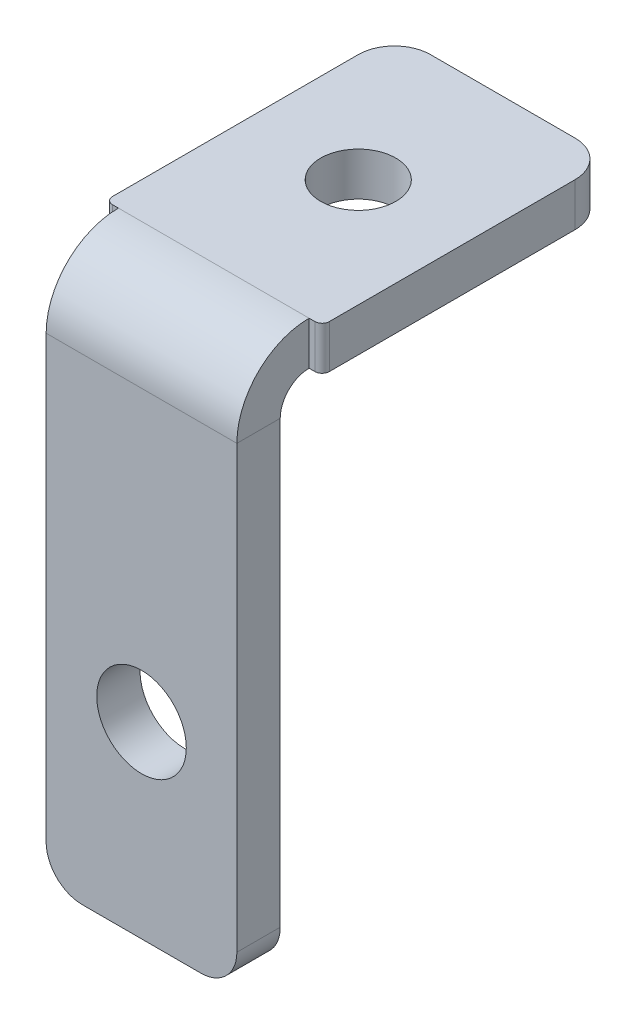
ISO-10303-21;
HEADER;
FILE_DESCRIPTION(('STEP AP214'),'2;1');
FILE_NAME('part.step','',(''),(''),'','','');
FILE_SCHEMA(('AUTOMOTIVE_DESIGN { 1 0 10303 214 1 1 1 1 }'));
ENDSEC;
DATA;
#1=APPLICATION_CONTEXT('core data for automotive mechanical design processes');
#2=APPLICATION_PROTOCOL_DEFINITION('international standard','automotive_design',2000,#1);
#3=PRODUCT_CONTEXT('',#1,'mechanical');
#4=PRODUCT('Part','Part','',(#3));
#5=PRODUCT_RELATED_PRODUCT_CATEGORY('part','',(#4));
#6=PRODUCT_DEFINITION_FORMATION('','',#4);
#7=PRODUCT_DEFINITION_CONTEXT('part definition',#1,'design');
#8=PRODUCT_DEFINITION('design','',#6,#7);
#9=PRODUCT_DEFINITION_SHAPE('','',#8);
#10=(LENGTH_UNIT() NAMED_UNIT(*) SI_UNIT(.MILLI.,.METRE.));
#11=(NAMED_UNIT(*) PLANE_ANGLE_UNIT() SI_UNIT($,.RADIAN.));
#12=(NAMED_UNIT(*) SI_UNIT($,.STERADIAN.) SOLID_ANGLE_UNIT());
#13=UNCERTAINTY_MEASURE_WITH_UNIT(LENGTH_MEASURE(1.E-05),#10,'distance_accuracy_value','');
#14=(GEOMETRIC_REPRESENTATION_CONTEXT(3) GLOBAL_UNCERTAINTY_ASSIGNED_CONTEXT((#13)) GLOBAL_UNIT_ASSIGNED_CONTEXT((#10,
#11,#12)) REPRESENTATION_CONTEXT('',''));
#15=CARTESIAN_POINT('',(0.,0.,0.));
#16=DIRECTION('',(0.,0.,1.));
#17=DIRECTION('',(1.,0.,0.));
#18=AXIS2_PLACEMENT_3D('',#15,#16,#17);
#19=CARTESIAN_POINT('',(6.6,-16.5,-3.));
#20=DIRECTION('',(1.,0.,0.));
#21=DIRECTION('',(0.,0.,-1.));
#22=AXIS2_PLACEMENT_3D('',#19,#20,#21);
#23=PLANE('',#22);
#24=DIRECTION('',(0.,1.,0.));
#25=VECTOR('',#24,1.);
#26=CARTESIAN_POINT('',(6.6,-16.5,0.));
#27=LINE('',#26,#25);
#28=CARTESIAN_POINT('',(6.6,-14.,0.));
#29=VERTEX_POINT('',#28);
#30=CARTESIAN_POINT('',(6.6,16.5,0.));
#31=VERTEX_POINT('',#30);
#32=EDGE_CURVE('E186',#29,#31,#27,.T.);
#33=ORIENTED_EDGE('',*,*,#32,.F.);
#34=DIRECTION('',(0.,0.,1.));
#35=VECTOR('',#34,1.);
#36=CARTESIAN_POINT('',(6.6,-14.,-3.));
#37=LINE('',#36,#35);
#38=CARTESIAN_POINT('',(6.6,-14.,-3.));
#39=VERTEX_POINT('',#38);
#40=EDGE_CURVE('E226',#29,#39,#37,.F.);
#41=ORIENTED_EDGE('',*,*,#40,.T.);
#42=DIRECTION('',(0.,1.,0.));
#43=VECTOR('',#42,1.);
#44=CARTESIAN_POINT('',(6.6,-16.5,-3.));
#45=LINE('',#44,#43);
#46=CARTESIAN_POINT('',(6.6,16.5,-3.));
#47=VERTEX_POINT('',#46);
#48=EDGE_CURVE('E187',#39,#47,#45,.T.);
#49=ORIENTED_EDGE('',*,*,#48,.T.);
#50=DIRECTION('',(0.,0.,1.));
#51=VECTOR('',#50,1.);
#52=CARTESIAN_POINT('',(6.6,16.5,-3.));
#53=LINE('',#52,#51);
#54=EDGE_CURVE('E199',#47,#31,#53,.T.);
#55=ORIENTED_EDGE('',*,*,#54,.T.);
#56=EDGE_LOOP('',(#33,#41,#49,#55));
#57=FACE_BOUND('',#56,.T.);
#58=ADVANCED_FACE('F16',(#57),#23,.T.);
#59=CARTESIAN_POINT('',(-6.6,-16.5,-3.));
#60=DIRECTION('',(0.,-1.,0.));
#61=DIRECTION('',(0.,0.,-1.));
#62=AXIS2_PLACEMENT_3D('',#59,#60,#61);
#63=PLANE('',#62);
#64=DIRECTION('',(1.,0.,0.));
#65=VECTOR('',#64,1.);
#66=CARTESIAN_POINT('',(-6.6,-16.5,-3.));
#67=LINE('',#66,#65);
#68=CARTESIAN_POINT('',(-4.1,-16.5,-3.));
#69=VERTEX_POINT('',#68);
#70=CARTESIAN_POINT('',(4.1,-16.5,-3.));
#71=VERTEX_POINT('',#70);
#72=EDGE_CURVE('E196',#69,#71,#67,.T.);
#73=ORIENTED_EDGE('',*,*,#72,.T.);
#74=DIRECTION('',(0.,0.,1.));
#75=VECTOR('',#74,1.);
#76=CARTESIAN_POINT('',(4.1,-16.5,-3.));
#77=LINE('',#76,#75);
#78=CARTESIAN_POINT('',(4.1,-16.5,0.));
#79=VERTEX_POINT('',#78);
#80=EDGE_CURVE('E219',#71,#79,#77,.T.);
#81=ORIENTED_EDGE('',*,*,#80,.T.);
#82=DIRECTION('',(1.,0.,0.));
#83=VECTOR('',#82,1.);
#84=CARTESIAN_POINT('',(-6.6,-16.5,0.));
#85=LINE('',#84,#83);
#86=CARTESIAN_POINT('',(-4.1,-16.5,0.));
#87=VERTEX_POINT('',#86);
#88=EDGE_CURVE('E190',#87,#79,#85,.T.);
#89=ORIENTED_EDGE('',*,*,#88,.F.);
#90=DIRECTION('',(0.,0.,1.));
#91=VECTOR('',#90,1.);
#92=CARTESIAN_POINT('',(-4.1,-16.5,-3.));
#93=LINE('',#92,#91);
#94=EDGE_CURVE('E214',#87,#69,#93,.F.);
#95=ORIENTED_EDGE('',*,*,#94,.T.);
#96=EDGE_LOOP('',(#73,#81,#89,#95));
#97=FACE_BOUND('',#96,.T.);
#98=ADVANCED_FACE('F290',(#97),#63,.T.);
#99=CARTESIAN_POINT('',(-6.6,-16.5,-3.));
#100=DIRECTION('',(-1.,0.,0.));
#101=DIRECTION('',(0.,0.,1.));
#102=AXIS2_PLACEMENT_3D('',#99,#100,#101);
#103=PLANE('',#102);
#104=DIRECTION('',(0.,-1.,0.));
#105=VECTOR('',#104,1.);
#106=CARTESIAN_POINT('',(-6.6,-16.5,-3.));
#107=LINE('',#106,#105);
#108=CARTESIAN_POINT('',(-6.6,16.5,-3.));
#109=VERTEX_POINT('',#108);
#110=CARTESIAN_POINT('',(-6.6,-14.,-3.));
#111=VERTEX_POINT('',#110);
#112=EDGE_CURVE('E193',#109,#111,#107,.T.);
#113=ORIENTED_EDGE('',*,*,#112,.T.);
#114=DIRECTION('',(0.,0.,1.));
#115=VECTOR('',#114,1.);
#116=CARTESIAN_POINT('',(-6.6,-14.,-3.));
#117=LINE('',#116,#115);
#118=CARTESIAN_POINT('',(-6.6,-14.,0.));
#119=VERTEX_POINT('',#118);
#120=EDGE_CURVE('E232',#111,#119,#117,.T.);
#121=ORIENTED_EDGE('',*,*,#120,.T.);
#122=DIRECTION('',(0.,-1.,0.));
#123=VECTOR('',#122,1.);
#124=CARTESIAN_POINT('',(-6.6,-16.5,0.));
#125=LINE('',#124,#123);
#126=CARTESIAN_POINT('',(-6.6,16.5,0.));
#127=VERTEX_POINT('',#126);
#128=EDGE_CURVE('E206',#127,#119,#125,.T.);
#129=ORIENTED_EDGE('',*,*,#128,.F.);
#130=DIRECTION('',(0.,0.,1.));
#131=VECTOR('',#130,1.);
#132=CARTESIAN_POINT('',(-6.6,16.5,-3.));
#133=LINE('',#132,#131);
#134=EDGE_CURVE('E137',#109,#127,#133,.T.);
#135=ORIENTED_EDGE('',*,*,#134,.F.);
#136=EDGE_LOOP('',(#113,#121,#129,#135));
#137=FACE_BOUND('',#136,.T.);
#138=ADVANCED_FACE('F296',(#137),#103,.T.);
#139=CARTESIAN_POINT('',(0.,0.,-3.));
#140=DIRECTION('',(0.,0.,-1.));
#141=DIRECTION('',(-1.,0.,0.));
#142=AXIS2_PLACEMENT_3D('',#139,#140,#141);
#143=PLANE('',#142);
#144=CARTESIAN_POINT('',(0.,-3.50000000000131,-3.));
#145=DIRECTION('',(0.,0.,1.));
#146=DIRECTION('',(1.,0.,0.));
#147=AXIS2_PLACEMENT_3D('',#144,#145,#146);
#148=CIRCLE('',#147,3.1);
#149=CARTESIAN_POINT('',(3.1,-3.50000000000131,-3.));
#150=VERTEX_POINT('',#149);
#151=EDGE_CURVE('E402',#150,#150,#148,.T.);
#152=ORIENTED_EDGE('',*,*,#151,.T.);
#153=EDGE_LOOP('',(#152));
#154=FACE_BOUND('',#153,.T.);
#155=ORIENTED_EDGE('',*,*,#48,.F.);
#156=CARTESIAN_POINT('',(4.1,-14.,-3.));
#157=DIRECTION('',(0.,0.,-1.));
#158=DIRECTION('',(-1.,0.,0.));
#159=AXIS2_PLACEMENT_3D('',#156,#157,#158);
#160=CIRCLE('',#159,2.5);
#161=EDGE_CURVE('E230',#39,#71,#160,.T.);
#162=ORIENTED_EDGE('',*,*,#161,.T.);
#163=ORIENTED_EDGE('',*,*,#72,.F.);
#164=CARTESIAN_POINT('',(-4.1,-14.,-3.));
#165=DIRECTION('',(0.,0.,-1.));
#166=DIRECTION('',(-1.,0.,0.));
#167=AXIS2_PLACEMENT_3D('',#164,#165,#166);
#168=CIRCLE('',#167,2.5);
#169=EDGE_CURVE('E228',#69,#111,#168,.T.);
#170=ORIENTED_EDGE('',*,*,#169,.T.);
#171=ORIENTED_EDGE('',*,*,#112,.F.);
#172=DIRECTION('',(-1.,0.,0.));
#173=VECTOR('',#172,1.);
#174=CARTESIAN_POINT('',(-6.6,16.5,-3.));
#175=LINE('',#174,#173);
#176=EDGE_CURVE('E189',#47,#109,#175,.T.);
#177=ORIENTED_EDGE('',*,*,#176,.F.);
#178=EDGE_LOOP('',(#155,#162,#163,#170,#171,#177));
#179=FACE_BOUND('',#178,.T.);
#180=ADVANCED_FACE('F375',(#154,#179),#143,.T.);
#181=CARTESIAN_POINT('',(0.,0.,0.));
#182=DIRECTION('',(0.,0.,-1.));
#183=DIRECTION('',(-1.,0.,0.));
#184=AXIS2_PLACEMENT_3D('',#181,#182,#183);
#185=PLANE('',#184);
#186=CARTESIAN_POINT('',(0.,-3.50000000000131,0.));
#187=DIRECTION('',(0.,0.,1.));
#188=DIRECTION('',(1.,0.,0.));
#189=AXIS2_PLACEMENT_3D('',#186,#187,#188);
#190=CIRCLE('',#189,3.1);
#191=CARTESIAN_POINT('',(3.1,-3.50000000000131,0.));
#192=VERTEX_POINT('',#191);
#193=EDGE_CURVE('E338',#192,#192,#190,.T.);
#194=ORIENTED_EDGE('',*,*,#193,.F.);
#195=EDGE_LOOP('',(#194));
#196=FACE_BOUND('',#195,.T.);
#197=ORIENTED_EDGE('',*,*,#88,.T.);
#198=CARTESIAN_POINT('',(4.1,-14.,0.));
#199=DIRECTION('',(0.,0.,-1.));
#200=DIRECTION('',(-1.,0.,0.));
#201=AXIS2_PLACEMENT_3D('',#198,#199,#200);
#202=CIRCLE('',#201,2.5);
#203=EDGE_CURVE('E224',#79,#29,#202,.F.);
#204=ORIENTED_EDGE('',*,*,#203,.T.);
#205=ORIENTED_EDGE('',*,*,#32,.T.);
#206=DIRECTION('',(-1.,0.,0.));
#207=VECTOR('',#206,1.);
#208=CARTESIAN_POINT('',(-6.6,16.5,0.));
#209=LINE('',#208,#207);
#210=EDGE_CURVE('E202',#31,#127,#209,.T.);
#211=ORIENTED_EDGE('',*,*,#210,.T.);
#212=ORIENTED_EDGE('',*,*,#128,.T.);
#213=CARTESIAN_POINT('',(-4.1,-14.,0.));
#214=DIRECTION('',(0.,0.,-1.));
#215=DIRECTION('',(-1.,0.,0.));
#216=AXIS2_PLACEMENT_3D('',#213,#214,#215);
#217=CIRCLE('',#216,2.5);
#218=EDGE_CURVE('E222',#119,#87,#217,.F.);
#219=ORIENTED_EDGE('',*,*,#218,.T.);
#220=EDGE_LOOP('',(#197,#204,#205,#211,#212,#219));
#221=FACE_BOUND('',#220,.T.);
#222=ADVANCED_FACE('F371',(#196,#221),#185,.F.);
#223=CARTESIAN_POINT('',(-6.6,16.5,-5.));
#224=DIRECTION('',(-1.,0.,0.));
#225=DIRECTION('',(0.,0.,1.));
#226=AXIS2_PLACEMENT_3D('',#223,#224,#225);
#227=PLANE('',#226);
#228=DIRECTION('',(0.,1.,0.));
#229=VECTOR('',#228,1.);
#230=CARTESIAN_POINT('',(-6.6,18.5,-4.99999999999999));
#231=LINE('',#230,#229);
#232=CARTESIAN_POINT('',(-6.6,18.5,-4.99999999999999));
#233=VERTEX_POINT('',#232);
#234=CARTESIAN_POINT('',(-6.6,21.5,-4.99999999999998));
#235=VERTEX_POINT('',#234);
#236=EDGE_CURVE('E134',#233,#235,#231,.T.);
#237=ORIENTED_EDGE('',*,*,#236,.F.);
#238=CARTESIAN_POINT('',(-6.6,16.5,-5.));
#239=DIRECTION('',(1.,0.,0.));
#240=DIRECTION('',(0.,0.,-1.));
#241=AXIS2_PLACEMENT_3D('',#238,#239,#240);
#242=CIRCLE('',#241,2.);
#243=EDGE_CURVE('E152',#109,#233,#242,.F.);
#244=ORIENTED_EDGE('',*,*,#243,.F.);
#245=ORIENTED_EDGE('',*,*,#134,.T.);
#246=CARTESIAN_POINT('',(-6.6,16.5,-5.));
#247=DIRECTION('',(1.,0.,0.));
#248=DIRECTION('',(0.,0.,-1.));
#249=AXIS2_PLACEMENT_3D('',#246,#247,#248);
#250=CIRCLE('',#249,5.);
#251=EDGE_CURVE('E129',#127,#235,#250,.F.);
#252=ORIENTED_EDGE('',*,*,#251,.T.);
#253=EDGE_LOOP('',(#237,#244,#245,#252));
#254=FACE_BOUND('',#253,.T.);
#255=ADVANCED_FACE('F131',(#254),#227,.T.);
#256=CARTESIAN_POINT('',(6.6,16.5,-5.));
#257=DIRECTION('',(-1.,0.,0.));
#258=DIRECTION('',(0.,0.,1.));
#259=AXIS2_PLACEMENT_3D('',#256,#257,#258);
#260=PLANE('',#259);
#261=CARTESIAN_POINT('',(6.6,16.5,-5.));
#262=DIRECTION('',(1.,0.,0.));
#263=DIRECTION('',(0.,0.,-1.));
#264=AXIS2_PLACEMENT_3D('',#261,#262,#263);
#265=CIRCLE('',#264,2.);
#266=CARTESIAN_POINT('',(6.6,18.5,-4.99999999999999));
#267=VERTEX_POINT('',#266);
#268=EDGE_CURVE('E177',#267,#47,#265,.T.);
#269=ORIENTED_EDGE('',*,*,#268,.F.);
#270=DIRECTION('',(0.,1.,0.));
#271=VECTOR('',#270,1.);
#272=CARTESIAN_POINT('',(6.6,18.5,-4.99999999999999));
#273=LINE('',#272,#271);
#274=CARTESIAN_POINT('',(6.6,21.5,-4.99999999999998));
#275=VERTEX_POINT('',#274);
#276=EDGE_CURVE('E161',#267,#275,#273,.T.);
#277=ORIENTED_EDGE('',*,*,#276,.T.);
#278=CARTESIAN_POINT('',(6.6,16.5,-5.));
#279=DIRECTION('',(1.,0.,0.));
#280=DIRECTION('',(0.,0.,-1.));
#281=AXIS2_PLACEMENT_3D('',#278,#279,#280);
#282=CIRCLE('',#281,5.);
#283=EDGE_CURVE('E141',#275,#31,#282,.T.);
#284=ORIENTED_EDGE('',*,*,#283,.T.);
#285=ORIENTED_EDGE('',*,*,#54,.F.);
#286=EDGE_LOOP('',(#269,#277,#284,#285));
#287=FACE_BOUND('',#286,.T.);
#288=ADVANCED_FACE('F365',(#287),#260,.F.);
#289=CARTESIAN_POINT('',(6.6,16.5,-5.));
#290=DIRECTION('',(1.,0.,0.));
#291=DIRECTION('',(0.,1.,0.));
#292=AXIS2_PLACEMENT_3D('',#289,#290,#291);
#293=CYLINDRICAL_SURFACE('',#292,5.);
#294=ORIENTED_EDGE('',*,*,#210,.F.);
#295=ORIENTED_EDGE('',*,*,#283,.F.);
#296=DIRECTION('',(1.,0.,0.));
#297=VECTOR('',#296,1.);
#298=CARTESIAN_POINT('',(6.6,21.5,-4.99999999999998));
#299=LINE('',#298,#297);
#300=EDGE_CURVE('E145',#235,#275,#299,.T.);
#301=ORIENTED_EDGE('',*,*,#300,.F.);
#302=ORIENTED_EDGE('',*,*,#251,.F.);
#303=EDGE_LOOP('',(#294,#295,#301,#302));
#304=FACE_BOUND('',#303,.T.);
#305=ADVANCED_FACE('F146',(#304),#293,.T.);
#306=CARTESIAN_POINT('',(6.6,16.5,-5.));
#307=DIRECTION('',(1.,0.,0.));
#308=DIRECTION('',(0.,1.,0.));
#309=AXIS2_PLACEMENT_3D('',#306,#307,#308);
#310=CYLINDRICAL_SURFACE('',#309,2.);
#311=ORIENTED_EDGE('',*,*,#176,.T.);
#312=ORIENTED_EDGE('',*,*,#243,.T.);
#313=DIRECTION('',(1.,0.,0.));
#314=VECTOR('',#313,1.);
#315=CARTESIAN_POINT('',(6.6,18.5,-4.99999999999999));
#316=LINE('',#315,#314);
#317=EDGE_CURVE('E180',#233,#267,#316,.T.);
#318=ORIENTED_EDGE('',*,*,#317,.T.);
#319=ORIENTED_EDGE('',*,*,#268,.T.);
#320=EDGE_LOOP('',(#311,#312,#318,#319));
#321=FACE_BOUND('',#320,.T.);
#322=ADVANCED_FACE('F364',(#321),#310,.F.);
#323=CARTESIAN_POINT('',(-7.5,18.5,-4.99999999999999));
#324=DIRECTION('',(0.,0.,1.));
#325=DIRECTION('',(0.,-1.,0.));
#326=AXIS2_PLACEMENT_3D('',#323,#324,#325);
#327=PLANE('',#326);
#328=DIRECTION('',(1.,0.,0.));
#329=VECTOR('',#328,1.);
#330=CARTESIAN_POINT('',(-7.5,18.5,-4.99999999999999));
#331=LINE('',#330,#329);
#332=CARTESIAN_POINT('',(7.,18.5,-4.99999999999999));
#333=VERTEX_POINT('',#332);
#334=EDGE_CURVE('E169',#267,#333,#331,.T.);
#335=ORIENTED_EDGE('',*,*,#334,.T.);
#336=DIRECTION('',(0.,1.,0.));
#337=VECTOR('',#336,1.);
#338=CARTESIAN_POINT('',(7.,21.5,-4.99999999999998));
#339=LINE('',#338,#337);
#340=CARTESIAN_POINT('',(7.,21.5,-4.99999999999998));
#341=VERTEX_POINT('',#340);
#342=EDGE_CURVE('E24',#333,#341,#339,.T.);
#343=ORIENTED_EDGE('',*,*,#342,.T.);
#344=DIRECTION('',(1.,0.,0.));
#345=VECTOR('',#344,1.);
#346=CARTESIAN_POINT('',(-7.5,21.5,-4.99999999999998));
#347=LINE('',#346,#345);
#348=EDGE_CURVE('E166',#341,#275,#347,.F.);
#349=ORIENTED_EDGE('',*,*,#348,.T.);
#350=ORIENTED_EDGE('',*,*,#276,.F.);
#351=EDGE_LOOP('',(#335,#343,#349,#350));
#352=FACE_BOUND('',#351,.T.);
#353=ADVANCED_FACE('F270',(#352),#327,.T.);
#354=CARTESIAN_POINT('',(7.5,21.5000000000001,-25.));
#355=DIRECTION('',(-1.,0.,0.));
#356=DIRECTION('',(0.,0.,1.));
#357=AXIS2_PLACEMENT_3D('',#354,#355,#356);
#358=PLANE('',#357);
#359=DIRECTION('',(0.,0.,-1.));
#360=VECTOR('',#359,1.);
#361=CARTESIAN_POINT('',(7.5,21.5,0.));
#362=LINE('',#361,#360);
#363=CARTESIAN_POINT('',(7.5,21.5,-5.49999999999998));
#364=VERTEX_POINT('',#363);
#365=CARTESIAN_POINT('',(7.5,21.5000000000001,-22.5));
#366=VERTEX_POINT('',#365);
#367=EDGE_CURVE('E273',#364,#366,#362,.T.);
#368=ORIENTED_EDGE('',*,*,#367,.F.);
#369=DIRECTION('',(0.,1.,0.));
#370=VECTOR('',#369,1.);
#371=CARTESIAN_POINT('',(7.5,18.5,-5.49999999999999));
#372=LINE('',#371,#370);
#373=CARTESIAN_POINT('',(7.5,18.5,-5.49999999999999));
#374=VERTEX_POINT('',#373);
#375=EDGE_CURVE('E10',#364,#374,#372,.F.);
#376=ORIENTED_EDGE('',*,*,#375,.T.);
#377=DIRECTION('',(0.,0.,1.));
#378=VECTOR('',#377,1.);
#379=CARTESIAN_POINT('',(7.5,18.5000000000001,-25.));
#380=LINE('',#379,#378);
#381=CARTESIAN_POINT('',(7.5,18.5000000000001,-22.5));
#382=VERTEX_POINT('',#381);
#383=EDGE_CURVE('E168',#374,#382,#380,.F.);
#384=ORIENTED_EDGE('',*,*,#383,.T.);
#385=DIRECTION('',(0.,-1.,0.));
#386=VECTOR('',#385,1.);
#387=CARTESIAN_POINT('',(7.5,21.5000000000001,-22.5));
#388=LINE('',#387,#386);
#389=EDGE_CURVE('E246',#382,#366,#388,.F.);
#390=ORIENTED_EDGE('',*,*,#389,.T.);
#391=EDGE_LOOP('',(#368,#376,#384,#390));
#392=FACE_BOUND('',#391,.T.);
#393=ADVANCED_FACE('F274',(#392),#358,.F.);
#394=CARTESIAN_POINT('',(-7.5,21.5,-2.99999999999999));
#395=DIRECTION('',(1.,0.,0.));
#396=DIRECTION('',(0.,0.,-1.));
#397=AXIS2_PLACEMENT_3D('',#394,#395,#396);
#398=PLANE('',#397);
#399=DIRECTION('',(0.,0.,-1.));
#400=VECTOR('',#399,1.);
#401=CARTESIAN_POINT('',(-7.5,18.5,-3.));
#402=LINE('',#401,#400);
#403=CARTESIAN_POINT('',(-7.5,18.5000000000001,-22.5));
#404=VERTEX_POINT('',#403);
#405=CARTESIAN_POINT('',(-7.5,18.5,-5.49999999999999));
#406=VERTEX_POINT('',#405);
#407=EDGE_CURVE('E279',#404,#406,#402,.F.);
#408=ORIENTED_EDGE('',*,*,#407,.T.);
#409=DIRECTION('',(0.,1.,0.));
#410=VECTOR('',#409,1.);
#411=CARTESIAN_POINT('',(-7.5,21.5,-5.49999999999998));
#412=LINE('',#411,#410);
#413=CARTESIAN_POINT('',(-7.5,21.5,-5.49999999999998));
#414=VERTEX_POINT('',#413);
#415=EDGE_CURVE('E257',#406,#414,#412,.T.);
#416=ORIENTED_EDGE('',*,*,#415,.T.);
#417=DIRECTION('',(0.,0.,1.));
#418=VECTOR('',#417,1.);
#419=CARTESIAN_POINT('',(-7.5,21.5,0.));
#420=LINE('',#419,#418);
#421=CARTESIAN_POINT('',(-7.5,21.5000000000001,-22.5));
#422=VERTEX_POINT('',#421);
#423=EDGE_CURVE('E182',#422,#414,#420,.T.);
#424=ORIENTED_EDGE('',*,*,#423,.F.);
#425=DIRECTION('',(0.,-1.,0.));
#426=VECTOR('',#425,1.);
#427=CARTESIAN_POINT('',(-7.5,21.5000000000001,-22.5));
#428=LINE('',#427,#426);
#429=EDGE_CURVE('E253',#422,#404,#428,.T.);
#430=ORIENTED_EDGE('',*,*,#429,.T.);
#431=EDGE_LOOP('',(#408,#416,#424,#430));
#432=FACE_BOUND('',#431,.T.);
#433=ADVANCED_FACE('F331',(#432),#398,.F.);
#434=CARTESIAN_POINT('',(0.,21.5,0.));
#435=DIRECTION('',(0.,-1.,0.));
#436=DIRECTION('',(0.,0.,-1.));
#437=AXIS2_PLACEMENT_3D('',#434,#435,#436);
#438=PLANE('',#437);
#439=CARTESIAN_POINT('',(0.,21.5,-15.));
#440=DIRECTION('',(0.,1.,0.));
#441=DIRECTION('',(0.,0.,1.));
#442=AXIS2_PLACEMENT_3D('',#439,#440,#441);
#443=CIRCLE('',#442,2.6);
#444=CARTESIAN_POINT('',(0.,21.5,-12.4));
#445=VERTEX_POINT('',#444);
#446=EDGE_CURVE('E411',#445,#445,#443,.T.);
#447=ORIENTED_EDGE('',*,*,#446,.F.);
#448=EDGE_LOOP('',(#447));
#449=FACE_BOUND('',#448,.T.);
#450=ORIENTED_EDGE('',*,*,#423,.T.);
#451=CARTESIAN_POINT('',(-7.,21.5,-5.49999999999998));
#452=DIRECTION('',(0.,-1.,0.));
#453=DIRECTION('',(0.,0.,-1.));
#454=AXIS2_PLACEMENT_3D('',#451,#452,#453);
#455=CIRCLE('',#454,0.5);
#456=CARTESIAN_POINT('',(-7.,21.5,-4.99999999999998));
#457=VERTEX_POINT('',#456);
#458=EDGE_CURVE('E165',#414,#457,#455,.F.);
#459=ORIENTED_EDGE('',*,*,#458,.T.);
#460=EDGE_CURVE('E157',#235,#457,#347,.F.);
#461=ORIENTED_EDGE('',*,*,#460,.F.);
#462=ORIENTED_EDGE('',*,*,#300,.T.);
#463=ORIENTED_EDGE('',*,*,#348,.F.);
#464=CARTESIAN_POINT('',(7.,21.5,-5.49999999999998));
#465=DIRECTION('',(0.,-1.,0.));
#466=DIRECTION('',(0.,0.,-1.));
#467=AXIS2_PLACEMENT_3D('',#464,#465,#466);
#468=CIRCLE('',#467,0.5);
#469=EDGE_CURVE('E260',#341,#364,#468,.F.);
#470=ORIENTED_EDGE('',*,*,#469,.T.);
#471=ORIENTED_EDGE('',*,*,#367,.T.);
#472=CARTESIAN_POINT('',(5.,21.5000000000001,-22.5));
#473=DIRECTION('',(0.,-1.,0.));
#474=DIRECTION('',(0.,0.,-1.));
#475=AXIS2_PLACEMENT_3D('',#472,#473,#474);
#476=CIRCLE('',#475,2.5);
#477=CARTESIAN_POINT('',(5.,21.5000000000001,-25.));
#478=VERTEX_POINT('',#477);
#479=EDGE_CURVE('E251',#366,#478,#476,.F.);
#480=ORIENTED_EDGE('',*,*,#479,.T.);
#481=DIRECTION('',(-1.,0.,0.));
#482=VECTOR('',#481,1.);
#483=CARTESIAN_POINT('',(0.,21.5000000000001,-25.));
#484=LINE('',#483,#482);
#485=CARTESIAN_POINT('',(-5.,21.5000000000001,-25.));
#486=VERTEX_POINT('',#485);
#487=EDGE_CURVE('E278',#478,#486,#484,.T.);
#488=ORIENTED_EDGE('',*,*,#487,.T.);
#489=CARTESIAN_POINT('',(-5.,21.5000000000001,-22.5));
#490=DIRECTION('',(0.,-1.,0.));
#491=DIRECTION('',(0.,0.,-1.));
#492=AXIS2_PLACEMENT_3D('',#489,#490,#491);
#493=CIRCLE('',#492,2.5);
#494=EDGE_CURVE('E249',#486,#422,#493,.F.);
#495=ORIENTED_EDGE('',*,*,#494,.T.);
#496=EDGE_LOOP('',(#450,#459,#461,#462,#463,#470,#471,#480,#488,#495));
#497=FACE_BOUND('',#496,.T.);
#498=ADVANCED_FACE('F164',(#449,#497),#438,.F.);
#499=CARTESIAN_POINT('',(0.,18.5,0.));
#500=DIRECTION('',(0.,-1.,0.));
#501=DIRECTION('',(0.,0.,-1.));
#502=AXIS2_PLACEMENT_3D('',#499,#500,#501);
#503=PLANE('',#502);
#504=CARTESIAN_POINT('',(0.,18.5,-15.));
#505=DIRECTION('',(0.,1.,0.));
#506=DIRECTION('',(0.,0.,1.));
#507=AXIS2_PLACEMENT_3D('',#504,#505,#506);
#508=CIRCLE('',#507,2.6);
#509=CARTESIAN_POINT('',(0.,18.5,-12.4));
#510=VERTEX_POINT('',#509);
#511=EDGE_CURVE('E409',#510,#510,#508,.T.);
#512=ORIENTED_EDGE('',*,*,#511,.T.);
#513=EDGE_LOOP('',(#512));
#514=FACE_BOUND('',#513,.T.);
#515=CARTESIAN_POINT('',(-7.,18.5,-4.99999999999999));
#516=VERTEX_POINT('',#515);
#517=EDGE_CURVE('E160',#516,#233,#331,.T.);
#518=ORIENTED_EDGE('',*,*,#517,.F.);
#519=CARTESIAN_POINT('',(-7.,18.5,-5.49999999999999));
#520=DIRECTION('',(0.,-1.,0.));
#521=DIRECTION('',(0.,0.,-1.));
#522=AXIS2_PLACEMENT_3D('',#519,#520,#521);
#523=CIRCLE('',#522,0.5);
#524=EDGE_CURVE('E266',#516,#406,#523,.T.);
#525=ORIENTED_EDGE('',*,*,#524,.T.);
#526=ORIENTED_EDGE('',*,*,#407,.F.);
#527=CARTESIAN_POINT('',(-5.,18.5000000000001,-22.5));
#528=DIRECTION('',(0.,-1.,0.));
#529=DIRECTION('',(0.,0.,-1.));
#530=AXIS2_PLACEMENT_3D('',#527,#528,#529);
#531=CIRCLE('',#530,2.5);
#532=CARTESIAN_POINT('',(-5.,18.5000000000001,-25.));
#533=VERTEX_POINT('',#532);
#534=EDGE_CURVE('E241',#404,#533,#531,.T.);
#535=ORIENTED_EDGE('',*,*,#534,.T.);
#536=DIRECTION('',(1.,0.,0.));
#537=VECTOR('',#536,1.);
#538=CARTESIAN_POINT('',(-7.5,18.5000000000001,-25.));
#539=LINE('',#538,#537);
#540=CARTESIAN_POINT('',(5.,18.5000000000001,-25.));
#541=VERTEX_POINT('',#540);
#542=EDGE_CURVE('E342',#541,#533,#539,.F.);
#543=ORIENTED_EDGE('',*,*,#542,.F.);
#544=CARTESIAN_POINT('',(5.,18.5000000000001,-22.5));
#545=DIRECTION('',(0.,-1.,0.));
#546=DIRECTION('',(0.,0.,-1.));
#547=AXIS2_PLACEMENT_3D('',#544,#545,#546);
#548=CIRCLE('',#547,2.5);
#549=EDGE_CURVE('E243',#541,#382,#548,.T.);
#550=ORIENTED_EDGE('',*,*,#549,.T.);
#551=ORIENTED_EDGE('',*,*,#383,.F.);
#552=CARTESIAN_POINT('',(7.,18.5,-5.49999999999999));
#553=DIRECTION('',(0.,-1.,0.));
#554=DIRECTION('',(0.,0.,-1.));
#555=AXIS2_PLACEMENT_3D('',#552,#553,#554);
#556=CIRCLE('',#555,0.5);
#557=EDGE_CURVE('E31',#374,#333,#556,.T.);
#558=ORIENTED_EDGE('',*,*,#557,.T.);
#559=ORIENTED_EDGE('',*,*,#334,.F.);
#560=ORIENTED_EDGE('',*,*,#317,.F.);
#561=EDGE_LOOP('',(#518,#525,#526,#535,#543,#550,#551,#558,#559,#560));
#562=FACE_BOUND('',#561,.T.);
#563=ADVANCED_FACE('F346',(#514,#562),#503,.T.);
#564=CARTESIAN_POINT('',(-7.5,21.5000000000001,-25.));
#565=DIRECTION('',(0.,0.,1.));
#566=DIRECTION('',(0.,-1.,0.));
#567=AXIS2_PLACEMENT_3D('',#564,#565,#566);
#568=PLANE('',#567);
#569=ORIENTED_EDGE('',*,*,#487,.F.);
#570=DIRECTION('',(0.,-1.,0.));
#571=VECTOR('',#570,1.);
#572=CARTESIAN_POINT('',(5.,21.5000000000001,-25.));
#573=LINE('',#572,#571);
#574=EDGE_CURVE('E237',#478,#541,#573,.T.);
#575=ORIENTED_EDGE('',*,*,#574,.T.);
#576=ORIENTED_EDGE('',*,*,#542,.T.);
#577=DIRECTION('',(0.,-1.,0.));
#578=VECTOR('',#577,1.);
#579=CARTESIAN_POINT('',(-5.,21.5000000000001,-25.));
#580=LINE('',#579,#578);
#581=EDGE_CURVE('E235',#533,#486,#580,.F.);
#582=ORIENTED_EDGE('',*,*,#581,.T.);
#583=EDGE_LOOP('',(#569,#575,#576,#582));
#584=FACE_BOUND('',#583,.T.);
#585=ADVANCED_FACE('F348',(#584),#568,.F.);
#586=ORIENTED_EDGE('',*,*,#460,.T.);
#587=DIRECTION('',(0.,1.,0.));
#588=VECTOR('',#587,1.);
#589=CARTESIAN_POINT('',(-7.,18.5,-4.99999999999999));
#590=LINE('',#589,#588);
#591=EDGE_CURVE('E263',#457,#516,#590,.F.);
#592=ORIENTED_EDGE('',*,*,#591,.T.);
#593=ORIENTED_EDGE('',*,*,#517,.T.);
#594=ORIENTED_EDGE('',*,*,#236,.T.);
#595=EDGE_LOOP('',(#586,#592,#593,#594));
#596=FACE_BOUND('',#595,.T.);
#597=ADVANCED_FACE('F156',(#596),#327,.T.);
#598=CARTESIAN_POINT('',(4.1,-14.,-3.));
#599=DIRECTION('',(0.,0.,1.));
#600=DIRECTION('',(1.,0.,0.));
#601=AXIS2_PLACEMENT_3D('',#598,#599,#600);
#602=CYLINDRICAL_SURFACE('',#601,2.5);
#603=ORIENTED_EDGE('',*,*,#161,.F.);
#604=ORIENTED_EDGE('',*,*,#40,.F.);
#605=ORIENTED_EDGE('',*,*,#203,.F.);
#606=ORIENTED_EDGE('',*,*,#80,.F.);
#607=EDGE_LOOP('',(#603,#604,#605,#606));
#608=FACE_BOUND('',#607,.T.);
#609=ADVANCED_FACE('F302',(#608),#602,.T.);
#610=CARTESIAN_POINT('',(-4.1,-14.,-3.));
#611=DIRECTION('',(0.,0.,1.));
#612=DIRECTION('',(1.,0.,0.));
#613=AXIS2_PLACEMENT_3D('',#610,#611,#612);
#614=CYLINDRICAL_SURFACE('',#613,2.5);
#615=ORIENTED_EDGE('',*,*,#169,.F.);
#616=ORIENTED_EDGE('',*,*,#94,.F.);
#617=ORIENTED_EDGE('',*,*,#218,.F.);
#618=ORIENTED_EDGE('',*,*,#120,.F.);
#619=EDGE_LOOP('',(#615,#616,#617,#618));
#620=FACE_BOUND('',#619,.T.);
#621=ADVANCED_FACE('F305',(#620),#614,.T.);
#622=CARTESIAN_POINT('',(5.,21.5000000000001,-22.5));
#623=DIRECTION('',(0.,-1.,0.));
#624=DIRECTION('',(0.,0.,-1.));
#625=AXIS2_PLACEMENT_3D('',#622,#623,#624);
#626=CYLINDRICAL_SURFACE('',#625,2.5);
#627=ORIENTED_EDGE('',*,*,#479,.F.);
#628=ORIENTED_EDGE('',*,*,#389,.F.);
#629=ORIENTED_EDGE('',*,*,#549,.F.);
#630=ORIENTED_EDGE('',*,*,#574,.F.);
#631=EDGE_LOOP('',(#627,#628,#629,#630));
#632=FACE_BOUND('',#631,.T.);
#633=ADVANCED_FACE('F309',(#632),#626,.T.);
#634=CARTESIAN_POINT('',(-5.,21.5000000000001,-22.5));
#635=DIRECTION('',(0.,-1.,0.));
#636=DIRECTION('',(0.,0.,-1.));
#637=AXIS2_PLACEMENT_3D('',#634,#635,#636);
#638=CYLINDRICAL_SURFACE('',#637,2.5);
#639=ORIENTED_EDGE('',*,*,#494,.F.);
#640=ORIENTED_EDGE('',*,*,#581,.F.);
#641=ORIENTED_EDGE('',*,*,#534,.F.);
#642=ORIENTED_EDGE('',*,*,#429,.F.);
#643=EDGE_LOOP('',(#639,#640,#641,#642));
#644=FACE_BOUND('',#643,.T.);
#645=ADVANCED_FACE('F313',(#644),#638,.T.);
#646=CARTESIAN_POINT('',(0.,-3.50000000000131,-3.));
#647=DIRECTION('',(0.,0.,1.));
#648=DIRECTION('',(1.,0.,0.));
#649=AXIS2_PLACEMENT_3D('',#646,#647,#648);
#650=CYLINDRICAL_SURFACE('',#649,3.1);
#651=ORIENTED_EDGE('',*,*,#151,.F.);
#652=EDGE_LOOP('',(#651));
#653=FACE_BOUND('',#652,.T.);
#654=ORIENTED_EDGE('',*,*,#193,.T.);
#655=EDGE_LOOP('',(#654));
#656=FACE_BOUND('',#655,.T.);
#657=ADVANCED_FACE('F316',(#653,#656),#650,.F.);
#658=CARTESIAN_POINT('',(0.,18.5,-15.));
#659=DIRECTION('',(0.,1.,0.));
#660=DIRECTION('',(0.,0.,1.));
#661=AXIS2_PLACEMENT_3D('',#658,#659,#660);
#662=CYLINDRICAL_SURFACE('',#661,2.6);
#663=ORIENTED_EDGE('',*,*,#511,.F.);
#664=EDGE_LOOP('',(#663));
#665=FACE_BOUND('',#664,.T.);
#666=ORIENTED_EDGE('',*,*,#446,.T.);
#667=EDGE_LOOP('',(#666));
#668=FACE_BOUND('',#667,.T.);
#669=ADVANCED_FACE('F287',(#665,#668),#662,.F.);
#670=CARTESIAN_POINT('',(-7.,21.5,-5.49999999999998));
#671=DIRECTION('',(0.,-1.,0.));
#672=DIRECTION('',(0.,0.,-1.));
#673=AXIS2_PLACEMENT_3D('',#670,#671,#672);
#674=CYLINDRICAL_SURFACE('',#673,0.5);
#675=ORIENTED_EDGE('',*,*,#524,.F.);
#676=ORIENTED_EDGE('',*,*,#591,.F.);
#677=ORIENTED_EDGE('',*,*,#458,.F.);
#678=ORIENTED_EDGE('',*,*,#415,.F.);
#679=EDGE_LOOP('',(#675,#676,#677,#678));
#680=FACE_BOUND('',#679,.T.);
#681=ADVANCED_FACE('F282',(#680),#674,.T.);
#682=CARTESIAN_POINT('',(7.,18.5,-5.49999999999999));
#683=DIRECTION('',(0.,-1.,0.));
#684=DIRECTION('',(0.,0.,-1.));
#685=AXIS2_PLACEMENT_3D('',#682,#683,#684);
#686=CYLINDRICAL_SURFACE('',#685,0.5);
#687=ORIENTED_EDGE('',*,*,#557,.F.);
#688=ORIENTED_EDGE('',*,*,#375,.F.);
#689=ORIENTED_EDGE('',*,*,#469,.F.);
#690=ORIENTED_EDGE('',*,*,#342,.F.);
#691=EDGE_LOOP('',(#687,#688,#689,#690));
#692=FACE_BOUND('',#691,.T.);
#693=ADVANCED_FACE('F18',(#692),#686,.T.);
#694=CLOSED_SHELL('',(#58,#98,#138,#180,#222,#255,#288,#305,#322,#353,#393,#433,#498,#563,#585,
#597,#609,#621,#633,#645,#657,#669,#681,#693));
#695=MANIFOLD_SOLID_BREP('B1',#694);
#696=ADVANCED_BREP_SHAPE_REPRESENTATION('',(#18,#695),#14);
#697=SHAPE_DEFINITION_REPRESENTATION(#9,#696);
ENDSEC;
END-ISO-10303-21;
